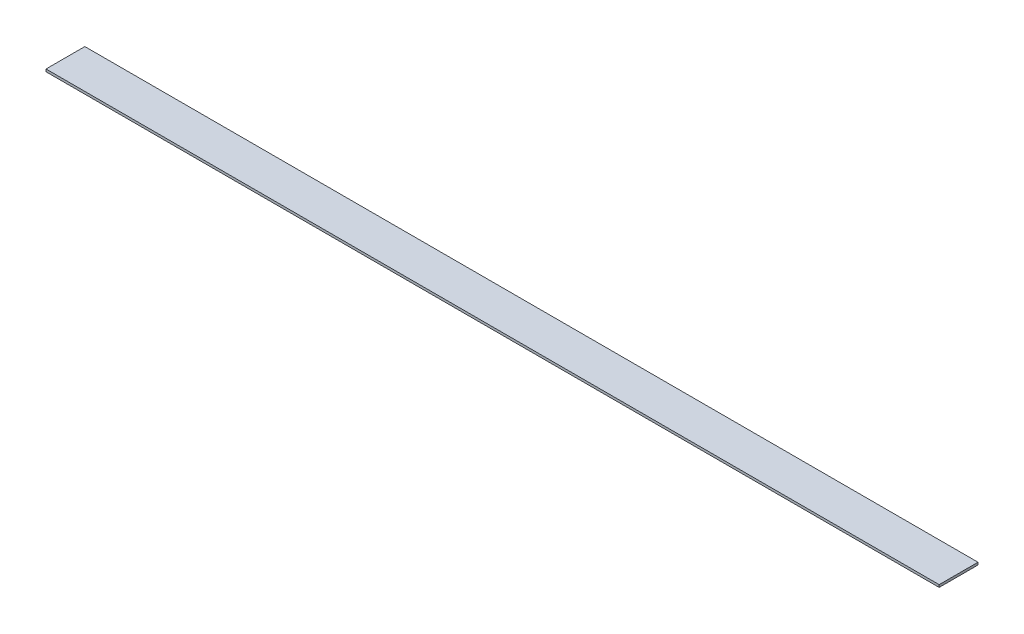
ISO-10303-21;
HEADER;
FILE_DESCRIPTION(('STEP AP214'),'2;1');
FILE_NAME('part.step','',(''),(''),'','','');
FILE_SCHEMA(('AUTOMOTIVE_DESIGN { 1 0 10303 214 1 1 1 1 }'));
ENDSEC;
DATA;
#1=APPLICATION_CONTEXT('core data for automotive mechanical design processes');
#2=APPLICATION_PROTOCOL_DEFINITION('international standard','automotive_design',2000,#1);
#3=PRODUCT_CONTEXT('',#1,'mechanical');
#4=PRODUCT('Part','Part','',(#3));
#5=PRODUCT_RELATED_PRODUCT_CATEGORY('part','',(#4));
#6=PRODUCT_DEFINITION_FORMATION('','',#4);
#7=PRODUCT_DEFINITION_CONTEXT('part definition',#1,'design');
#8=PRODUCT_DEFINITION('design','',#6,#7);
#9=PRODUCT_DEFINITION_SHAPE('','',#8);
#10=(LENGTH_UNIT() NAMED_UNIT(*) SI_UNIT(.MILLI.,.METRE.));
#11=(NAMED_UNIT(*) PLANE_ANGLE_UNIT() SI_UNIT($,.RADIAN.));
#12=(NAMED_UNIT(*) SI_UNIT($,.STERADIAN.) SOLID_ANGLE_UNIT());
#13=UNCERTAINTY_MEASURE_WITH_UNIT(LENGTH_MEASURE(1.E-05),#10,'distance_accuracy_value','');
#14=(GEOMETRIC_REPRESENTATION_CONTEXT(3) GLOBAL_UNCERTAINTY_ASSIGNED_CONTEXT((#13)) GLOBAL_UNIT_ASSIGNED_CONTEXT((#10,
#11,#12)) REPRESENTATION_CONTEXT('',''));
#15=CARTESIAN_POINT('',(0.,0.,0.));
#16=DIRECTION('',(0.,0.,1.));
#17=DIRECTION('',(1.,0.,0.));
#18=AXIS2_PLACEMENT_3D('',#15,#16,#17);
#19=CARTESIAN_POINT('',(-584.2,3.175,25.4000000000001));
#20=DIRECTION('',(1.,0.,0.));
#21=DIRECTION('',(0.,0.,-1.));
#22=AXIS2_PLACEMENT_3D('',#19,#20,#21);
#23=PLANE('',#22);
#24=DIRECTION('',(0.,0.,1.));
#25=VECTOR('',#24,1.);
#26=CARTESIAN_POINT('',(-584.2,0.,25.4000000000001));
#27=LINE('',#26,#25);
#28=CARTESIAN_POINT('',(-584.2,0.,-25.3999999999999));
#29=VERTEX_POINT('',#28);
#30=CARTESIAN_POINT('',(-584.2,0.,25.4000000000001));
#31=VERTEX_POINT('',#30);
#32=EDGE_CURVE('E99',#29,#31,#27,.T.);
#33=ORIENTED_EDGE('',*,*,#32,.T.);
#34=DIRECTION('',(0.,-1.,0.));
#35=VECTOR('',#34,1.);
#36=CARTESIAN_POINT('',(-584.2,3.175,25.4000000000001));
#37=LINE('',#36,#35);
#38=CARTESIAN_POINT('',(-584.2,3.175,25.4000000000001));
#39=VERTEX_POINT('',#38);
#40=EDGE_CURVE('E11',#39,#31,#37,.T.);
#41=ORIENTED_EDGE('',*,*,#40,.F.);
#42=DIRECTION('',(0.,0.,1.));
#43=VECTOR('',#42,1.);
#44=CARTESIAN_POINT('',(-584.2,3.175,25.4000000000001));
#45=LINE('',#44,#43);
#46=CARTESIAN_POINT('',(-584.2,3.175,-25.3999999999999));
#47=VERTEX_POINT('',#46);
#48=EDGE_CURVE('E87',#47,#39,#45,.T.);
#49=ORIENTED_EDGE('',*,*,#48,.F.);
#50=DIRECTION('',(0.,-1.,0.));
#51=VECTOR('',#50,1.);
#52=CARTESIAN_POINT('',(-584.2,3.175,-25.3999999999999));
#53=LINE('',#52,#51);
#54=EDGE_CURVE('E95',#47,#29,#53,.T.);
#55=ORIENTED_EDGE('',*,*,#54,.T.);
#56=EDGE_LOOP('',(#33,#41,#49,#55));
#57=FACE_BOUND('',#56,.T.);
#58=ADVANCED_FACE('F36',(#57),#23,.F.);
#59=CARTESIAN_POINT('',(584.2,3.175,25.3999999999999));
#60=DIRECTION('',(0.,0.,-1.));
#61=DIRECTION('',(-1.,0.,0.));
#62=AXIS2_PLACEMENT_3D('',#59,#60,#61);
#63=PLANE('',#62);
#64=DIRECTION('',(1.,0.,0.));
#65=VECTOR('',#64,1.);
#66=CARTESIAN_POINT('',(584.2,0.,25.3999999999999));
#67=LINE('',#66,#65);
#68=CARTESIAN_POINT('',(584.2,0.,25.3999999999999));
#69=VERTEX_POINT('',#68);
#70=EDGE_CURVE('E91',#31,#69,#67,.T.);
#71=ORIENTED_EDGE('',*,*,#70,.T.);
#72=DIRECTION('',(0.,-1.,0.));
#73=VECTOR('',#72,1.);
#74=CARTESIAN_POINT('',(584.2,3.175,25.3999999999999));
#75=LINE('',#74,#73);
#76=CARTESIAN_POINT('',(584.2,3.175,25.3999999999999));
#77=VERTEX_POINT('',#76);
#78=EDGE_CURVE('E44',#77,#69,#75,.T.);
#79=ORIENTED_EDGE('',*,*,#78,.F.);
#80=DIRECTION('',(1.,0.,0.));
#81=VECTOR('',#80,1.);
#82=CARTESIAN_POINT('',(584.2,3.175,25.3999999999999));
#83=LINE('',#82,#81);
#84=EDGE_CURVE('E82',#39,#77,#83,.T.);
#85=ORIENTED_EDGE('',*,*,#84,.F.);
#86=ORIENTED_EDGE('',*,*,#40,.T.);
#87=EDGE_LOOP('',(#71,#79,#85,#86));
#88=FACE_BOUND('',#87,.T.);
#89=ADVANCED_FACE('F90',(#88),#63,.F.);
#90=CARTESIAN_POINT('',(584.2,3.175,25.3999999999999));
#91=DIRECTION('',(-1.,0.,0.));
#92=DIRECTION('',(0.,0.,1.));
#93=AXIS2_PLACEMENT_3D('',#90,#91,#92);
#94=PLANE('',#93);
#95=DIRECTION('',(0.,0.,-1.));
#96=VECTOR('',#95,1.);
#97=CARTESIAN_POINT('',(584.2,0.,25.3999999999999));
#98=LINE('',#97,#96);
#99=CARTESIAN_POINT('',(584.2,0.,-25.4000000000001));
#100=VERTEX_POINT('',#99);
#101=EDGE_CURVE('E69',#69,#100,#98,.T.);
#102=ORIENTED_EDGE('',*,*,#101,.T.);
#103=DIRECTION('',(0.,-1.,0.));
#104=VECTOR('',#103,1.);
#105=CARTESIAN_POINT('',(584.2,3.175,-25.4000000000001));
#106=LINE('',#105,#104);
#107=CARTESIAN_POINT('',(584.2,3.175,-25.4000000000001));
#108=VERTEX_POINT('',#107);
#109=EDGE_CURVE('E92',#108,#100,#106,.T.);
#110=ORIENTED_EDGE('',*,*,#109,.F.);
#111=DIRECTION('',(0.,0.,-1.));
#112=VECTOR('',#111,1.);
#113=CARTESIAN_POINT('',(584.2,3.175,25.3999999999999));
#114=LINE('',#113,#112);
#115=EDGE_CURVE('E85',#77,#108,#114,.T.);
#116=ORIENTED_EDGE('',*,*,#115,.F.);
#117=ORIENTED_EDGE('',*,*,#78,.T.);
#118=EDGE_LOOP('',(#102,#110,#116,#117));
#119=FACE_BOUND('',#118,.T.);
#120=ADVANCED_FACE('F93',(#119),#94,.F.);
#121=CARTESIAN_POINT('',(584.2,3.175,-25.4000000000001));
#122=DIRECTION('',(0.,0.,1.));
#123=DIRECTION('',(1.,0.,0.));
#124=AXIS2_PLACEMENT_3D('',#121,#122,#123);
#125=PLANE('',#124);
#126=DIRECTION('',(-1.,0.,0.));
#127=VECTOR('',#126,1.);
#128=CARTESIAN_POINT('',(584.2,0.,-25.4000000000001));
#129=LINE('',#128,#127);
#130=EDGE_CURVE('E75',#100,#29,#129,.T.);
#131=ORIENTED_EDGE('',*,*,#130,.T.);
#132=ORIENTED_EDGE('',*,*,#54,.F.);
#133=DIRECTION('',(-1.,0.,0.));
#134=VECTOR('',#133,1.);
#135=CARTESIAN_POINT('',(584.2,3.175,-25.4000000000001));
#136=LINE('',#135,#134);
#137=EDGE_CURVE('E52',#108,#47,#136,.T.);
#138=ORIENTED_EDGE('',*,*,#137,.F.);
#139=ORIENTED_EDGE('',*,*,#109,.T.);
#140=EDGE_LOOP('',(#131,#132,#138,#139));
#141=FACE_BOUND('',#140,.T.);
#142=ADVANCED_FACE('F106',(#141),#125,.F.);
#143=CARTESIAN_POINT('',(0.,3.175,0.));
#144=DIRECTION('',(0.,1.,0.));
#145=DIRECTION('',(0.,0.,1.));
#146=AXIS2_PLACEMENT_3D('',#143,#144,#145);
#147=PLANE('',#146);
#148=ORIENTED_EDGE('',*,*,#48,.T.);
#149=ORIENTED_EDGE('',*,*,#84,.T.);
#150=ORIENTED_EDGE('',*,*,#115,.T.);
#151=ORIENTED_EDGE('',*,*,#137,.T.);
#152=EDGE_LOOP('',(#148,#149,#150,#151));
#153=FACE_BOUND('',#152,.T.);
#154=ADVANCED_FACE('F83',(#153),#147,.T.);
#155=CARTESIAN_POINT('',(0.,0.,0.));
#156=DIRECTION('',(0.,1.,0.));
#157=DIRECTION('',(0.,0.,1.));
#158=AXIS2_PLACEMENT_3D('',#155,#156,#157);
#159=PLANE('',#158);
#160=ORIENTED_EDGE('',*,*,#32,.F.);
#161=ORIENTED_EDGE('',*,*,#130,.F.);
#162=ORIENTED_EDGE('',*,*,#101,.F.);
#163=ORIENTED_EDGE('',*,*,#70,.F.);
#164=EDGE_LOOP('',(#160,#161,#162,#163));
#165=FACE_BOUND('',#164,.T.);
#166=ADVANCED_FACE('F109',(#165),#159,.F.);
#167=CLOSED_SHELL('',(#58,#89,#120,#142,#154,#166));
#168=MANIFOLD_SOLID_BREP('B2',#167);
#169=ADVANCED_BREP_SHAPE_REPRESENTATION('',(#18,#168),#14);
#170=SHAPE_DEFINITION_REPRESENTATION(#9,#169);
ENDSEC;
END-ISO-10303-21;
